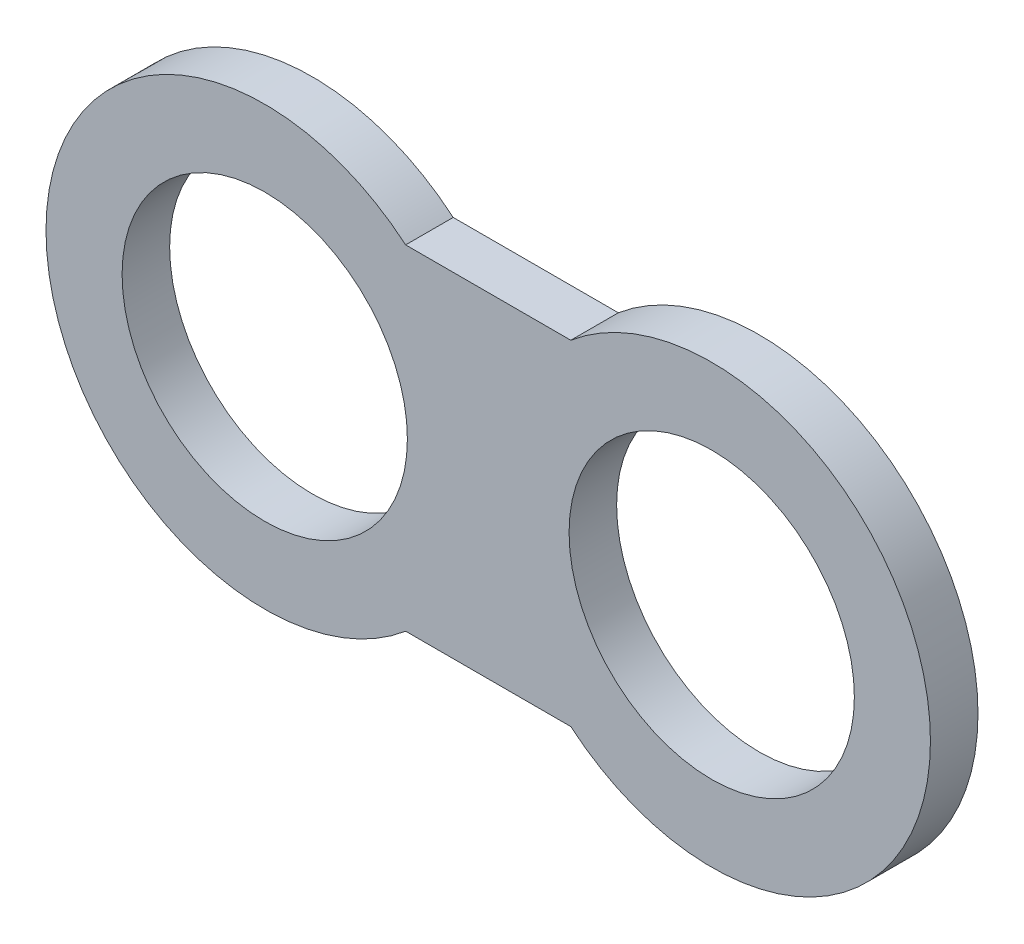
ISO-10303-21;
HEADER;
FILE_DESCRIPTION(('STEP AP214'),'2;1');
FILE_NAME('part.step','',(''),(''),'','','');
FILE_SCHEMA(('AUTOMOTIVE_DESIGN { 1 0 10303 214 1 1 1 1 }'));
ENDSEC;
DATA;
#1=APPLICATION_CONTEXT('core data for automotive mechanical design processes');
#2=APPLICATION_PROTOCOL_DEFINITION('international standard','automotive_design',2000,#1);
#3=PRODUCT_CONTEXT('',#1,'mechanical');
#4=PRODUCT('Part','Part','',(#3));
#5=PRODUCT_RELATED_PRODUCT_CATEGORY('part','',(#4));
#6=PRODUCT_DEFINITION_FORMATION('','',#4);
#7=PRODUCT_DEFINITION_CONTEXT('part definition',#1,'design');
#8=PRODUCT_DEFINITION('design','',#6,#7);
#9=PRODUCT_DEFINITION_SHAPE('','',#8);
#10=(LENGTH_UNIT() NAMED_UNIT(*) SI_UNIT(.MILLI.,.METRE.));
#11=(NAMED_UNIT(*) PLANE_ANGLE_UNIT() SI_UNIT($,.RADIAN.));
#12=(NAMED_UNIT(*) SI_UNIT($,.STERADIAN.) SOLID_ANGLE_UNIT());
#13=UNCERTAINTY_MEASURE_WITH_UNIT(LENGTH_MEASURE(1.E-05),#10,'distance_accuracy_value','');
#14=(GEOMETRIC_REPRESENTATION_CONTEXT(3) GLOBAL_UNCERTAINTY_ASSIGNED_CONTEXT((#13)) GLOBAL_UNIT_ASSIGNED_CONTEXT((#10,
#11,#12)) REPRESENTATION_CONTEXT('',''));
#15=CARTESIAN_POINT('',(0.,0.,0.));
#16=DIRECTION('',(0.,0.,1.));
#17=DIRECTION('',(1.,0.,0.));
#18=AXIS2_PLACEMENT_3D('',#15,#16,#17);
#19=CARTESIAN_POINT('',(0.,175.909198011507,-25.));
#20=DIRECTION('',(0.,-1.,0.));
#21=DIRECTION('',(0.,0.,-1.));
#22=AXIS2_PLACEMENT_3D('',#19,#20,#21);
#23=PLANE('',#22);
#24=DIRECTION('',(0.,0.,1.));
#25=VECTOR('',#24,1.);
#26=CARTESIAN_POINT('',(-101.8245835,175.909198011507,-25.));
#27=LINE('',#26,#25);
#28=CARTESIAN_POINT('',(-101.8245835,175.909198011507,-25.));
#29=VERTEX_POINT('',#28);
#30=CARTESIAN_POINT('',(-101.8245835,175.909198011507,25.));
#31=VERTEX_POINT('',#30);
#32=EDGE_CURVE('E44',#29,#31,#27,.T.);
#33=ORIENTED_EDGE('',*,*,#32,.T.);
#34=DIRECTION('',(1.,0.,0.));
#35=VECTOR('',#34,1.);
#36=CARTESIAN_POINT('',(0.,175.909198011507,25.));
#37=LINE('',#36,#35);
#38=CARTESIAN_POINT('',(71.8245835,175.909198011507,25.));
#39=VERTEX_POINT('',#38);
#40=EDGE_CURVE('E85',#31,#39,#37,.T.);
#41=ORIENTED_EDGE('',*,*,#40,.T.);
#42=DIRECTION('',(0.,0.,1.));
#43=VECTOR('',#42,1.);
#44=CARTESIAN_POINT('',(71.8245835,175.909198011507,-25.));
#45=LINE('',#44,#43);
#46=CARTESIAN_POINT('',(71.8245835,175.909198011507,-25.));
#47=VERTEX_POINT('',#46);
#48=EDGE_CURVE('E11',#47,#39,#45,.T.);
#49=ORIENTED_EDGE('',*,*,#48,.F.);
#50=DIRECTION('',(1.,0.,0.));
#51=VECTOR('',#50,1.);
#52=CARTESIAN_POINT('',(0.,175.909198011507,-25.));
#53=LINE('',#52,#51);
#54=EDGE_CURVE('E57',#29,#47,#53,.T.);
#55=ORIENTED_EDGE('',*,*,#54,.F.);
#56=EDGE_LOOP('',(#33,#41,#49,#55));
#57=FACE_BOUND('',#56,.T.);
#58=ADVANCED_FACE('F41',(#57),#23,.F.);
#59=CARTESIAN_POINT('',(220.,0.,-25.));
#60=DIRECTION('',(0.,0.,1.));
#61=DIRECTION('',(1.,0.,0.));
#62=AXIS2_PLACEMENT_3D('',#59,#60,#61);
#63=CYLINDRICAL_SURFACE('',#62,230.);
#64=ORIENTED_EDGE('',*,*,#48,.T.);
#65=CARTESIAN_POINT('',(220.,0.,25.));
#66=DIRECTION('',(0.,0.,1.));
#67=DIRECTION('',(1.,0.,0.));
#68=AXIS2_PLACEMENT_3D('',#65,#66,#67);
#69=CIRCLE('',#68,230.);
#70=CARTESIAN_POINT('',(71.8245835,-175.909198011507,25.));
#71=VERTEX_POINT('',#70);
#72=EDGE_CURVE('E102',#71,#39,#69,.T.);
#73=ORIENTED_EDGE('',*,*,#72,.F.);
#74=DIRECTION('',(0.,0.,1.));
#75=VECTOR('',#74,1.);
#76=CARTESIAN_POINT('',(71.8245835,-175.909198011507,-25.));
#77=LINE('',#76,#75);
#78=CARTESIAN_POINT('',(71.8245835,-175.909198011507,-25.));
#79=VERTEX_POINT('',#78);
#80=EDGE_CURVE('E49',#79,#71,#77,.T.);
#81=ORIENTED_EDGE('',*,*,#80,.F.);
#82=CARTESIAN_POINT('',(220.,0.,-25.));
#83=DIRECTION('',(0.,0.,1.));
#84=DIRECTION('',(1.,0.,0.));
#85=AXIS2_PLACEMENT_3D('',#82,#83,#84);
#86=CIRCLE('',#85,230.);
#87=EDGE_CURVE('E118',#79,#47,#86,.T.);
#88=ORIENTED_EDGE('',*,*,#87,.T.);
#89=EDGE_LOOP('',(#64,#73,#81,#88));
#90=FACE_BOUND('',#89,.T.);
#91=ADVANCED_FACE('F127',(#90),#63,.T.);
#92=CARTESIAN_POINT('',(0.,-175.909198011507,-25.));
#93=DIRECTION('',(0.,1.,0.));
#94=DIRECTION('',(-1.,0.,0.));
#95=AXIS2_PLACEMENT_3D('',#92,#93,#94);
#96=PLANE('',#95);
#97=ORIENTED_EDGE('',*,*,#80,.T.);
#98=DIRECTION('',(-1.,0.,0.));
#99=VECTOR('',#98,1.);
#100=CARTESIAN_POINT('',(0.,-175.909198011507,25.));
#101=LINE('',#100,#99);
#102=CARTESIAN_POINT('',(-101.8245835,-175.909198011507,25.));
#103=VERTEX_POINT('',#102);
#104=EDGE_CURVE('E97',#71,#103,#101,.T.);
#105=ORIENTED_EDGE('',*,*,#104,.T.);
#106=DIRECTION('',(0.,0.,1.));
#107=VECTOR('',#106,1.);
#108=CARTESIAN_POINT('',(-101.8245835,-175.909198011507,-25.));
#109=LINE('',#108,#107);
#110=CARTESIAN_POINT('',(-101.8245835,-175.909198011507,-25.));
#111=VERTEX_POINT('',#110);
#112=EDGE_CURVE('E88',#111,#103,#109,.T.);
#113=ORIENTED_EDGE('',*,*,#112,.F.);
#114=DIRECTION('',(-1.,0.,0.));
#115=VECTOR('',#114,1.);
#116=CARTESIAN_POINT('',(0.,-175.909198011507,-25.));
#117=LINE('',#116,#115);
#118=EDGE_CURVE('E116',#79,#111,#117,.T.);
#119=ORIENTED_EDGE('',*,*,#118,.F.);
#120=EDGE_LOOP('',(#97,#105,#113,#119));
#121=FACE_BOUND('',#120,.T.);
#122=ADVANCED_FACE('F126',(#121),#96,.F.);
#123=CARTESIAN_POINT('',(-250.,0.,-25.));
#124=DIRECTION('',(0.,0.,1.));
#125=DIRECTION('',(1.,0.,0.));
#126=AXIS2_PLACEMENT_3D('',#123,#124,#125);
#127=CYLINDRICAL_SURFACE('',#126,150.);
#128=CARTESIAN_POINT('',(-250.,0.,25.));
#129=DIRECTION('',(0.,0.,1.));
#130=DIRECTION('',(1.,0.,0.));
#131=AXIS2_PLACEMENT_3D('',#128,#129,#130);
#132=CIRCLE('',#131,150.);
#133=CARTESIAN_POINT('',(-99.9999999999999,0.,25.));
#134=VERTEX_POINT('',#133);
#135=EDGE_CURVE('E107',#134,#134,#132,.T.);
#136=ORIENTED_EDGE('',*,*,#135,.T.);
#137=EDGE_LOOP('',(#136));
#138=FACE_BOUND('',#137,.T.);
#139=CARTESIAN_POINT('',(-250.,0.,-25.));
#140=DIRECTION('',(0.,0.,1.));
#141=DIRECTION('',(1.,0.,0.));
#142=AXIS2_PLACEMENT_3D('',#139,#140,#141);
#143=CIRCLE('',#142,150.);
#144=CARTESIAN_POINT('',(-99.9999999999999,0.,-25.));
#145=VERTEX_POINT('',#144);
#146=EDGE_CURVE('E120',#145,#145,#143,.T.);
#147=ORIENTED_EDGE('',*,*,#146,.F.);
#148=EDGE_LOOP('',(#147));
#149=FACE_BOUND('',#148,.T.);
#150=ADVANCED_FACE('F137',(#138,#149),#127,.F.);
#151=CARTESIAN_POINT('',(-250.,0.,-25.));
#152=DIRECTION('',(0.,0.,1.));
#153=DIRECTION('',(1.,0.,0.));
#154=AXIS2_PLACEMENT_3D('',#151,#152,#153);
#155=CYLINDRICAL_SURFACE('',#154,230.);
#156=CARTESIAN_POINT('',(-250.,0.,25.));
#157=DIRECTION('',(0.,0.,1.));
#158=DIRECTION('',(1.,0.,0.));
#159=AXIS2_PLACEMENT_3D('',#156,#157,#158);
#160=CIRCLE('',#159,230.);
#161=EDGE_CURVE('E91',#31,#103,#160,.T.);
#162=ORIENTED_EDGE('',*,*,#161,.F.);
#163=ORIENTED_EDGE('',*,*,#32,.F.);
#164=CARTESIAN_POINT('',(-250.,0.,-25.));
#165=DIRECTION('',(0.,0.,1.));
#166=DIRECTION('',(1.,0.,0.));
#167=AXIS2_PLACEMENT_3D('',#164,#165,#166);
#168=CIRCLE('',#167,230.);
#169=EDGE_CURVE('E114',#29,#111,#168,.T.);
#170=ORIENTED_EDGE('',*,*,#169,.T.);
#171=ORIENTED_EDGE('',*,*,#112,.T.);
#172=EDGE_LOOP('',(#162,#163,#170,#171));
#173=FACE_BOUND('',#172,.T.);
#174=ADVANCED_FACE('F92',(#173),#155,.T.);
#175=CARTESIAN_POINT('',(220.,0.,-25.));
#176=DIRECTION('',(0.,0.,1.));
#177=DIRECTION('',(1.,0.,0.));
#178=AXIS2_PLACEMENT_3D('',#175,#176,#177);
#179=CYLINDRICAL_SURFACE('',#178,150.);
#180=CARTESIAN_POINT('',(220.,0.,-25.));
#181=DIRECTION('',(0.,0.,1.));
#182=DIRECTION('',(1.,0.,0.));
#183=AXIS2_PLACEMENT_3D('',#180,#181,#182);
#184=CIRCLE('',#183,150.);
#185=CARTESIAN_POINT('',(370.,0.,-25.));
#186=VERTEX_POINT('',#185);
#187=EDGE_CURVE('E89',#186,#186,#184,.T.);
#188=ORIENTED_EDGE('',*,*,#187,.F.);
#189=EDGE_LOOP('',(#188));
#190=FACE_BOUND('',#189,.T.);
#191=CARTESIAN_POINT('',(220.,0.,25.));
#192=DIRECTION('',(0.,0.,1.));
#193=DIRECTION('',(1.,0.,0.));
#194=AXIS2_PLACEMENT_3D('',#191,#192,#193);
#195=CIRCLE('',#194,150.);
#196=CARTESIAN_POINT('',(370.,0.,25.));
#197=VERTEX_POINT('',#196);
#198=EDGE_CURVE('E110',#197,#197,#195,.T.);
#199=ORIENTED_EDGE('',*,*,#198,.T.);
#200=EDGE_LOOP('',(#199));
#201=FACE_BOUND('',#200,.T.);
#202=ADVANCED_FACE('F131',(#190,#201),#179,.F.);
#203=CARTESIAN_POINT('',(0.,0.,-25.));
#204=DIRECTION('',(0.,0.,1.));
#205=DIRECTION('',(1.,0.,0.));
#206=AXIS2_PLACEMENT_3D('',#203,#204,#205);
#207=PLANE('',#206);
#208=ORIENTED_EDGE('',*,*,#118,.T.);
#209=ORIENTED_EDGE('',*,*,#169,.F.);
#210=ORIENTED_EDGE('',*,*,#54,.T.);
#211=ORIENTED_EDGE('',*,*,#87,.F.);
#212=EDGE_LOOP('',(#208,#209,#210,#211));
#213=FACE_BOUND('',#212,.T.);
#214=ORIENTED_EDGE('',*,*,#187,.T.);
#215=EDGE_LOOP('',(#214));
#216=FACE_BOUND('',#215,.T.);
#217=ORIENTED_EDGE('',*,*,#146,.T.);
#218=EDGE_LOOP('',(#217));
#219=FACE_BOUND('',#218,.T.);
#220=ADVANCED_FACE('F128',(#213,#216,#219),#207,.F.);
#221=CARTESIAN_POINT('',(0.,0.,25.));
#222=DIRECTION('',(0.,0.,1.));
#223=DIRECTION('',(1.,0.,0.));
#224=AXIS2_PLACEMENT_3D('',#221,#222,#223);
#225=PLANE('',#224);
#226=ORIENTED_EDGE('',*,*,#40,.F.);
#227=ORIENTED_EDGE('',*,*,#161,.T.);
#228=ORIENTED_EDGE('',*,*,#104,.F.);
#229=ORIENTED_EDGE('',*,*,#72,.T.);
#230=EDGE_LOOP('',(#226,#227,#228,#229));
#231=FACE_BOUND('',#230,.T.);
#232=ORIENTED_EDGE('',*,*,#135,.F.);
#233=EDGE_LOOP('',(#232));
#234=FACE_BOUND('',#233,.T.);
#235=ORIENTED_EDGE('',*,*,#198,.F.);
#236=EDGE_LOOP('',(#235));
#237=FACE_BOUND('',#236,.T.);
#238=ADVANCED_FACE('F100',(#231,#234,#237),#225,.T.);
#239=CLOSED_SHELL('',(#58,#91,#122,#150,#174,#202,#220,#238));
#240=MANIFOLD_SOLID_BREP('B2',#239);
#241=ADVANCED_BREP_SHAPE_REPRESENTATION('',(#18,#240),#14);
#242=SHAPE_DEFINITION_REPRESENTATION(#9,#241);
ENDSEC;
END-ISO-10303-21;
